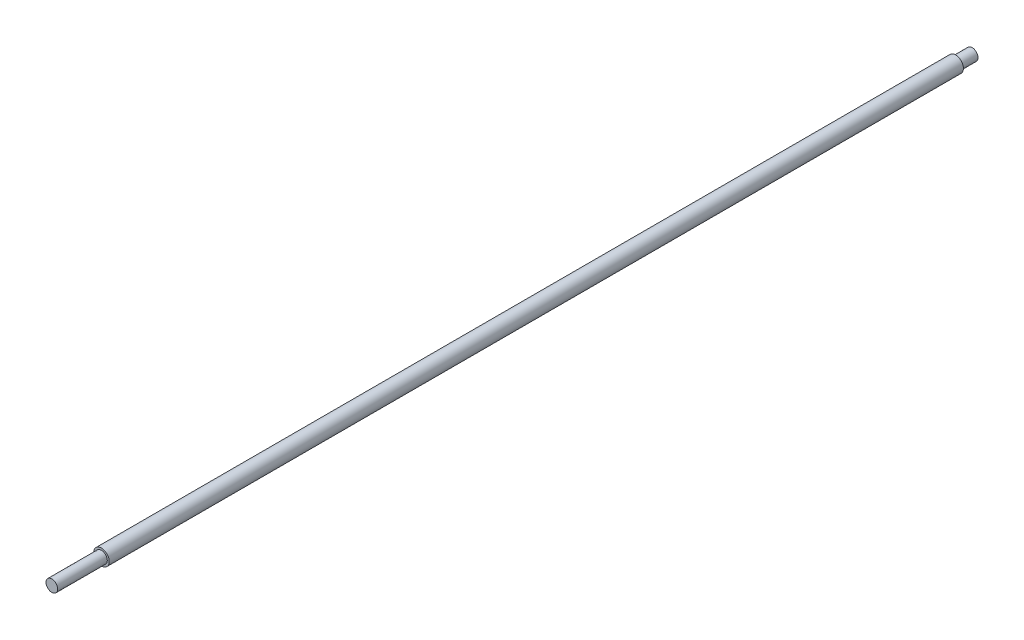
ISO-10303-21;
HEADER;
FILE_DESCRIPTION(('STEP AP214'),'2;1');
FILE_NAME('part.step','',(''),(''),'','','');
FILE_SCHEMA(('AUTOMOTIVE_DESIGN { 1 0 10303 214 1 1 1 1 }'));
ENDSEC;
DATA;
#1=APPLICATION_CONTEXT('core data for automotive mechanical design processes');
#2=APPLICATION_PROTOCOL_DEFINITION('international standard','automotive_design',2000,#1);
#3=PRODUCT_CONTEXT('',#1,'mechanical');
#4=PRODUCT('Part','Part','',(#3));
#5=PRODUCT_RELATED_PRODUCT_CATEGORY('part','',(#4));
#6=PRODUCT_DEFINITION_FORMATION('','',#4);
#7=PRODUCT_DEFINITION_CONTEXT('part definition',#1,'design');
#8=PRODUCT_DEFINITION('design','',#6,#7);
#9=PRODUCT_DEFINITION_SHAPE('','',#8);
#10=(LENGTH_UNIT() NAMED_UNIT(*) SI_UNIT(.MILLI.,.METRE.));
#11=(NAMED_UNIT(*) PLANE_ANGLE_UNIT() SI_UNIT($,.RADIAN.));
#12=(NAMED_UNIT(*) SI_UNIT($,.STERADIAN.) SOLID_ANGLE_UNIT());
#13=UNCERTAINTY_MEASURE_WITH_UNIT(LENGTH_MEASURE(1.E-05),#10,'distance_accuracy_value','');
#14=(GEOMETRIC_REPRESENTATION_CONTEXT(3) GLOBAL_UNCERTAINTY_ASSIGNED_CONTEXT((#13)) GLOBAL_UNIT_ASSIGNED_CONTEXT((#10,
#11,#12)) REPRESENTATION_CONTEXT('',''));
#15=CARTESIAN_POINT('',(0.,0.,0.));
#16=DIRECTION('',(0.,0.,1.));
#17=DIRECTION('',(1.,0.,0.));
#18=AXIS2_PLACEMENT_3D('',#15,#16,#17);
#19=CARTESIAN_POINT('',(0.,0.,946.));
#20=DIRECTION('',(0.,0.,-1.));
#21=DIRECTION('',(-1.,0.,0.));
#22=AXIS2_PLACEMENT_3D('',#19,#20,#21);
#23=CYLINDRICAL_SURFACE('',#22,8.);
#24=CARTESIAN_POINT('',(0.,0.,17.));
#25=DIRECTION('',(0.,0.,-1.));
#26=DIRECTION('',(-1.,0.,0.));
#27=AXIS2_PLACEMENT_3D('',#24,#25,#26);
#28=CIRCLE('',#27,8.);
#29=CARTESIAN_POINT('',(-8.,0.,17.));
#30=VERTEX_POINT('',#29);
#31=EDGE_CURVE('E46',#30,#30,#28,.T.);
#32=ORIENTED_EDGE('',*,*,#31,.F.);
#33=EDGE_LOOP('',(#32));
#34=FACE_BOUND('',#33,.T.);
#35=CARTESIAN_POINT('',(0.,0.,895.));
#36=DIRECTION('',(0.,0.,1.));
#37=DIRECTION('',(1.,0.,0.));
#38=AXIS2_PLACEMENT_3D('',#35,#36,#37);
#39=CIRCLE('',#38,8.);
#40=CARTESIAN_POINT('',(8.,0.,895.));
#41=VERTEX_POINT('',#40);
#42=EDGE_CURVE('E49',#41,#41,#39,.T.);
#43=ORIENTED_EDGE('',*,*,#42,.F.);
#44=EDGE_LOOP('',(#43));
#45=FACE_BOUND('',#44,.T.);
#46=ADVANCED_FACE('F27',(#34,#45),#23,.T.);
#47=CARTESIAN_POINT('',(0.,0.,17.));
#48=DIRECTION('',(0.,0.,-1.));
#49=DIRECTION('',(-1.,0.,0.));
#50=AXIS2_PLACEMENT_3D('',#47,#48,#49);
#51=PLANE('',#50);
#52=ORIENTED_EDGE('',*,*,#31,.T.);
#53=EDGE_LOOP('',(#52));
#54=FACE_BOUND('',#53,.T.);
#55=CARTESIAN_POINT('',(0.,0.,17.));
#56=DIRECTION('',(0.,0.,-1.));
#57=DIRECTION('',(-1.,0.,0.));
#58=AXIS2_PLACEMENT_3D('',#55,#56,#57);
#59=CIRCLE('',#58,6.);
#60=CARTESIAN_POINT('',(-6.,0.,17.));
#61=VERTEX_POINT('',#60);
#62=EDGE_CURVE('E33',#61,#61,#59,.F.);
#63=ORIENTED_EDGE('',*,*,#62,.T.);
#64=EDGE_LOOP('',(#63));
#65=FACE_BOUND('',#64,.T.);
#66=ADVANCED_FACE('F56',(#54,#65),#51,.T.);
#67=CARTESIAN_POINT('',(0.,0.,0.));
#68=DIRECTION('',(0.,0.,1.));
#69=DIRECTION('',(1.,0.,0.));
#70=AXIS2_PLACEMENT_3D('',#67,#68,#69);
#71=PLANE('',#70);
#72=CARTESIAN_POINT('',(0.,0.,0.));
#73=DIRECTION('',(0.,0.,-1.));
#74=DIRECTION('',(-1.,0.,0.));
#75=AXIS2_PLACEMENT_3D('',#72,#73,#74);
#76=CIRCLE('',#75,6.);
#77=CARTESIAN_POINT('',(-6.,0.,0.));
#78=VERTEX_POINT('',#77);
#79=EDGE_CURVE('E41',#78,#78,#76,.T.);
#80=ORIENTED_EDGE('',*,*,#79,.T.);
#81=EDGE_LOOP('',(#80));
#82=FACE_BOUND('',#81,.T.);
#83=ADVANCED_FACE('F63',(#82),#71,.F.);
#84=CARTESIAN_POINT('',(0.,0.,20.));
#85=DIRECTION('',(0.,0.,-1.));
#86=DIRECTION('',(-1.,0.,0.));
#87=AXIS2_PLACEMENT_3D('',#84,#85,#86);
#88=CYLINDRICAL_SURFACE('',#87,6.);
#89=ORIENTED_EDGE('',*,*,#62,.F.);
#90=EDGE_LOOP('',(#89));
#91=FACE_BOUND('',#90,.T.);
#92=ORIENTED_EDGE('',*,*,#79,.F.);
#93=EDGE_LOOP('',(#92));
#94=FACE_BOUND('',#93,.T.);
#95=ADVANCED_FACE('F70',(#91,#94),#88,.T.);
#96=CARTESIAN_POINT('',(0.,0.,895.));
#97=DIRECTION('',(0.,0.,1.));
#98=DIRECTION('',(1.,0.,0.));
#99=AXIS2_PLACEMENT_3D('',#96,#97,#98);
#100=PLANE('',#99);
#101=ORIENTED_EDGE('',*,*,#42,.T.);
#102=EDGE_LOOP('',(#101));
#103=FACE_BOUND('',#102,.T.);
#104=CARTESIAN_POINT('',(0.,0.,895.));
#105=DIRECTION('',(0.,0.,1.));
#106=DIRECTION('',(1.,0.,0.));
#107=AXIS2_PLACEMENT_3D('',#104,#105,#106);
#108=CIRCLE('',#107,6.);
#109=CARTESIAN_POINT('',(6.,0.,895.));
#110=VERTEX_POINT('',#109);
#111=EDGE_CURVE('E10',#110,#110,#108,.F.);
#112=ORIENTED_EDGE('',*,*,#111,.T.);
#113=EDGE_LOOP('',(#112));
#114=FACE_BOUND('',#113,.T.);
#115=ADVANCED_FACE('F53',(#103,#114),#100,.T.);
#116=CARTESIAN_POINT('',(0.,0.,946.));
#117=DIRECTION('',(0.,0.,1.));
#118=DIRECTION('',(1.,0.,0.));
#119=AXIS2_PLACEMENT_3D('',#116,#117,#118);
#120=PLANE('',#119);
#121=CARTESIAN_POINT('',(0.,0.,946.));
#122=DIRECTION('',(0.,0.,1.));
#123=DIRECTION('',(1.,0.,0.));
#124=AXIS2_PLACEMENT_3D('',#121,#122,#123);
#125=CIRCLE('',#124,6.);
#126=CARTESIAN_POINT('',(6.,0.,946.));
#127=VERTEX_POINT('',#126);
#128=EDGE_CURVE('E37',#127,#127,#125,.T.);
#129=ORIENTED_EDGE('',*,*,#128,.T.);
#130=EDGE_LOOP('',(#129));
#131=FACE_BOUND('',#130,.T.);
#132=ADVANCED_FACE('F79',(#131),#120,.T.);
#133=CARTESIAN_POINT('',(0.,0.,892.));
#134=DIRECTION('',(0.,0.,1.));
#135=DIRECTION('',(1.,0.,0.));
#136=AXIS2_PLACEMENT_3D('',#133,#134,#135);
#137=CYLINDRICAL_SURFACE('',#136,6.);
#138=ORIENTED_EDGE('',*,*,#111,.F.);
#139=EDGE_LOOP('',(#138));
#140=FACE_BOUND('',#139,.T.);
#141=ORIENTED_EDGE('',*,*,#128,.F.);
#142=EDGE_LOOP('',(#141));
#143=FACE_BOUND('',#142,.T.);
#144=ADVANCED_FACE('F77',(#140,#143),#137,.T.);
#145=CLOSED_SHELL('',(#46,#66,#83,#95,#115,#132,#144));
#146=MANIFOLD_SOLID_BREP('B2',#145);
#147=ADVANCED_BREP_SHAPE_REPRESENTATION('',(#18,#146),#14);
#148=SHAPE_DEFINITION_REPRESENTATION(#9,#147);
ENDSEC;
END-ISO-10303-21;
